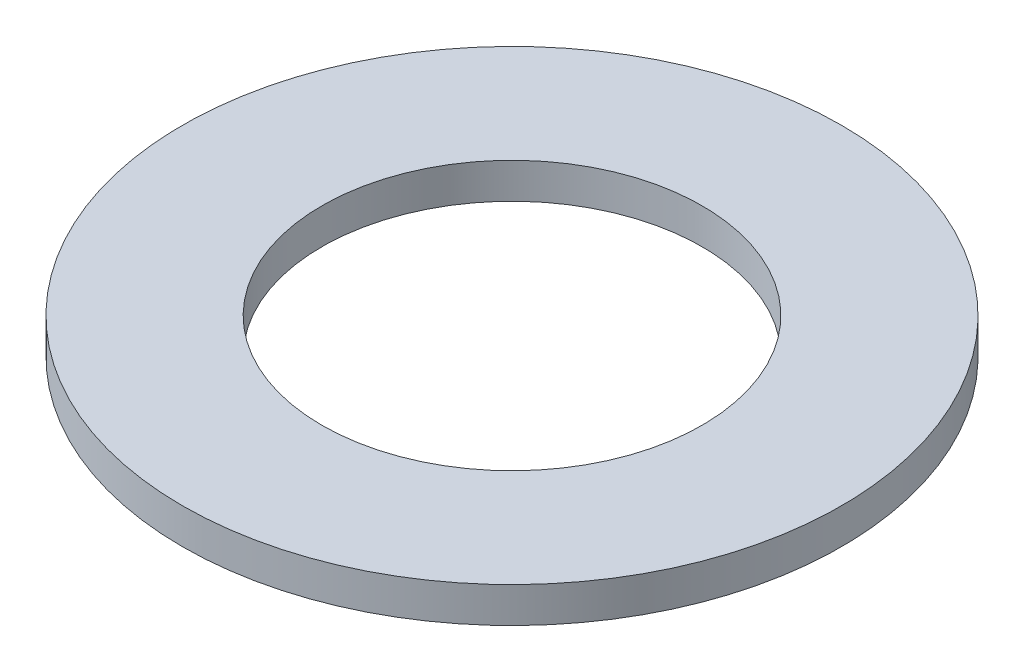
ISO-10303-21;
HEADER;
FILE_DESCRIPTION(('STEP AP214'),'2;1');
FILE_NAME('part.step','',(''),(''),'','','');
FILE_SCHEMA(('AUTOMOTIVE_DESIGN { 1 0 10303 214 1 1 1 1 }'));
ENDSEC;
DATA;
#1=APPLICATION_CONTEXT('core data for automotive mechanical design processes');
#2=APPLICATION_PROTOCOL_DEFINITION('international standard','automotive_design',2000,#1);
#3=PRODUCT_CONTEXT('',#1,'mechanical');
#4=PRODUCT('Part','Part','',(#3));
#5=PRODUCT_RELATED_PRODUCT_CATEGORY('part','',(#4));
#6=PRODUCT_DEFINITION_FORMATION('','',#4);
#7=PRODUCT_DEFINITION_CONTEXT('part definition',#1,'design');
#8=PRODUCT_DEFINITION('design','',#6,#7);
#9=PRODUCT_DEFINITION_SHAPE('','',#8);
#10=(LENGTH_UNIT() NAMED_UNIT(*) SI_UNIT(.MILLI.,.METRE.));
#11=(NAMED_UNIT(*) PLANE_ANGLE_UNIT() SI_UNIT($,.RADIAN.));
#12=(NAMED_UNIT(*) SI_UNIT($,.STERADIAN.) SOLID_ANGLE_UNIT());
#13=UNCERTAINTY_MEASURE_WITH_UNIT(LENGTH_MEASURE(1.E-05),#10,'distance_accuracy_value','');
#14=(GEOMETRIC_REPRESENTATION_CONTEXT(3) GLOBAL_UNCERTAINTY_ASSIGNED_CONTEXT((#13)) GLOBAL_UNIT_ASSIGNED_CONTEXT((#10,
#11,#12)) REPRESENTATION_CONTEXT('',''));
#15=CARTESIAN_POINT('',(0.,0.,0.));
#16=DIRECTION('',(0.,0.,1.));
#17=DIRECTION('',(1.,0.,0.));
#18=AXIS2_PLACEMENT_3D('',#15,#16,#17);
#19=CARTESIAN_POINT('',(0.,7.,0.));
#20=DIRECTION('',(0.,-1.,0.));
#21=DIRECTION('',(0.,0.,-1.));
#22=AXIS2_PLACEMENT_3D('',#19,#20,#21);
#23=CYLINDRICAL_SURFACE('',#22,65.);
#24=CARTESIAN_POINT('',(0.,7.,0.));
#25=DIRECTION('',(0.,1.,0.));
#26=DIRECTION('',(0.,0.,1.));
#27=AXIS2_PLACEMENT_3D('',#24,#25,#26);
#28=CIRCLE('',#27,65.);
#29=CARTESIAN_POINT('',(0.,7.,65.));
#30=VERTEX_POINT('',#29);
#31=EDGE_CURVE('E10',#30,#30,#28,.T.);
#32=ORIENTED_EDGE('',*,*,#31,.F.);
#33=EDGE_LOOP('',(#32));
#34=FACE_BOUND('',#33,.T.);
#35=CARTESIAN_POINT('',(0.,0.,0.));
#36=DIRECTION('',(0.,1.,0.));
#37=DIRECTION('',(0.,0.,1.));
#38=AXIS2_PLACEMENT_3D('',#35,#36,#37);
#39=CIRCLE('',#38,65.);
#40=CARTESIAN_POINT('',(0.,0.,65.));
#41=VERTEX_POINT('',#40);
#42=EDGE_CURVE('E37',#41,#41,#39,.T.);
#43=ORIENTED_EDGE('',*,*,#42,.T.);
#44=EDGE_LOOP('',(#43));
#45=FACE_BOUND('',#44,.T.);
#46=ADVANCED_FACE('F40',(#34,#45),#23,.T.);
#47=CARTESIAN_POINT('',(0.,7.,0.));
#48=DIRECTION('',(0.,1.,0.));
#49=DIRECTION('',(0.,0.,1.));
#50=AXIS2_PLACEMENT_3D('',#47,#48,#49);
#51=PLANE('',#50);
#52=CARTESIAN_POINT('',(0.,7.,0.));
#53=DIRECTION('',(0.,1.,0.));
#54=DIRECTION('',(0.,0.,1.));
#55=AXIS2_PLACEMENT_3D('',#52,#53,#54);
#56=CIRCLE('',#55,37.5);
#57=CARTESIAN_POINT('',(0.,7.,37.5));
#58=VERTEX_POINT('',#57);
#59=EDGE_CURVE('E50',#58,#58,#56,.T.);
#60=ORIENTED_EDGE('',*,*,#59,.F.);
#61=EDGE_LOOP('',(#60));
#62=FACE_BOUND('',#61,.T.);
#63=ORIENTED_EDGE('',*,*,#31,.T.);
#64=EDGE_LOOP('',(#63));
#65=FACE_BOUND('',#64,.T.);
#66=ADVANCED_FACE('F59',(#62,#65),#51,.T.);
#67=CARTESIAN_POINT('',(0.,0.,0.));
#68=DIRECTION('',(0.,1.,0.));
#69=DIRECTION('',(0.,0.,1.));
#70=AXIS2_PLACEMENT_3D('',#67,#68,#69);
#71=PLANE('',#70);
#72=CARTESIAN_POINT('',(0.,0.,0.));
#73=DIRECTION('',(0.,1.,0.));
#74=DIRECTION('',(0.,0.,1.));
#75=AXIS2_PLACEMENT_3D('',#72,#73,#74);
#76=CIRCLE('',#75,37.5);
#77=CARTESIAN_POINT('',(0.,0.,37.5));
#78=VERTEX_POINT('',#77);
#79=EDGE_CURVE('E47',#78,#78,#76,.T.);
#80=ORIENTED_EDGE('',*,*,#79,.T.);
#81=EDGE_LOOP('',(#80));
#82=FACE_BOUND('',#81,.T.);
#83=ORIENTED_EDGE('',*,*,#42,.F.);
#84=EDGE_LOOP('',(#83));
#85=FACE_BOUND('',#84,.T.);
#86=ADVANCED_FACE('F58',(#82,#85),#71,.F.);
#87=CARTESIAN_POINT('',(0.,7.,0.));
#88=DIRECTION('',(0.,-1.,0.));
#89=DIRECTION('',(0.,0.,-1.));
#90=AXIS2_PLACEMENT_3D('',#87,#88,#89);
#91=CYLINDRICAL_SURFACE('',#90,37.5);
#92=ORIENTED_EDGE('',*,*,#59,.T.);
#93=EDGE_LOOP('',(#92));
#94=FACE_BOUND('',#93,.T.);
#95=ORIENTED_EDGE('',*,*,#79,.F.);
#96=EDGE_LOOP('',(#95));
#97=FACE_BOUND('',#96,.T.);
#98=ADVANCED_FACE('F54',(#94,#97),#91,.F.);
#99=CLOSED_SHELL('',(#46,#66,#86,#98));
#100=MANIFOLD_SOLID_BREP('B2',#99);
#101=ADVANCED_BREP_SHAPE_REPRESENTATION('',(#18,#100),#14);
#102=SHAPE_DEFINITION_REPRESENTATION(#9,#101);
ENDSEC;
END-ISO-10303-21;
